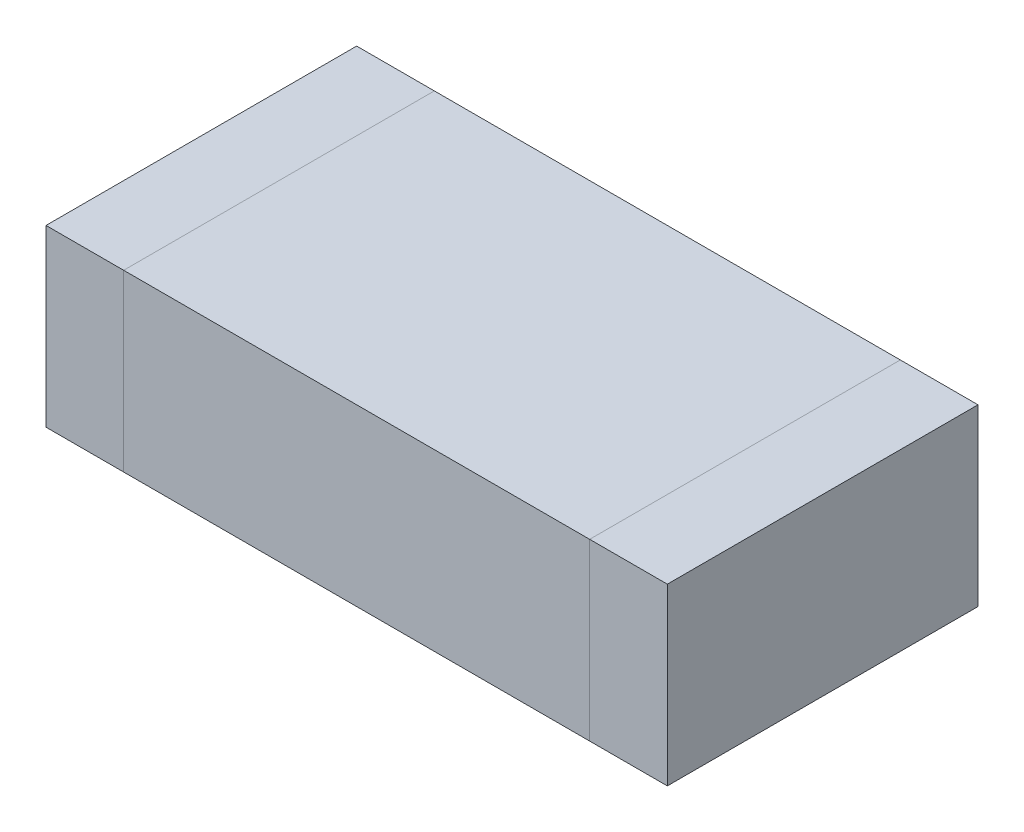
ISO-10303-21;
HEADER;
FILE_DESCRIPTION(('STEP AP214'),'2;1');
FILE_NAME('part.step','',(''),(''),'','','');
FILE_SCHEMA(('AUTOMOTIVE_DESIGN { 1 0 10303 214 1 1 1 1 }'));
ENDSEC;
DATA;
#1=APPLICATION_CONTEXT('core data for automotive mechanical design processes');
#2=APPLICATION_PROTOCOL_DEFINITION('international standard','automotive_design',2000,#1);
#3=PRODUCT_CONTEXT('',#1,'mechanical');
#4=PRODUCT('Part','Part','',(#3));
#5=PRODUCT_RELATED_PRODUCT_CATEGORY('part','',(#4));
#6=PRODUCT_DEFINITION_FORMATION('','',#4);
#7=PRODUCT_DEFINITION_CONTEXT('part definition',#1,'design');
#8=PRODUCT_DEFINITION('design','',#6,#7);
#9=PRODUCT_DEFINITION_SHAPE('','',#8);
#10=(LENGTH_UNIT() NAMED_UNIT(*) SI_UNIT(.MILLI.,.METRE.));
#11=(NAMED_UNIT(*) PLANE_ANGLE_UNIT() SI_UNIT($,.RADIAN.));
#12=(NAMED_UNIT(*) SI_UNIT($,.STERADIAN.) SOLID_ANGLE_UNIT());
#13=UNCERTAINTY_MEASURE_WITH_UNIT(LENGTH_MEASURE(1.E-05),#10,'distance_accuracy_value','');
#14=(GEOMETRIC_REPRESENTATION_CONTEXT(3) GLOBAL_UNCERTAINTY_ASSIGNED_CONTEXT((#13)) GLOBAL_UNIT_ASSIGNED_CONTEXT((#10,
#11,#12)) REPRESENTATION_CONTEXT('',''));
#15=CARTESIAN_POINT('',(0.,0.,0.));
#16=DIRECTION('',(0.,0.,1.));
#17=DIRECTION('',(1.,0.,0.));
#18=AXIS2_PLACEMENT_3D('',#15,#16,#17);
#19=CARTESIAN_POINT('',(-0.6,0.45,0.));
#20=DIRECTION('',(1.,0.,0.));
#21=DIRECTION('',(0.,0.,-1.));
#22=AXIS2_PLACEMENT_3D('',#19,#20,#21);
#23=PLANE('',#22);
#24=DIRECTION('',(0.,0.,1.));
#25=VECTOR('',#24,1.);
#26=CARTESIAN_POINT('',(-0.6,0.45,0.));
#27=LINE('',#26,#25);
#28=CARTESIAN_POINT('',(-0.6,0.45,0.4));
#29=VERTEX_POINT('',#28);
#30=CARTESIAN_POINT('',(-0.6,0.45,-0.4));
#31=VERTEX_POINT('',#30);
#32=EDGE_CURVE('P0_E58',#29,#31,#27,.F.);
#33=ORIENTED_EDGE('',*,*,#32,.F.);
#34=DIRECTION('',(0.,1.,0.));
#35=VECTOR('',#34,1.);
#36=CARTESIAN_POINT('',(-0.6,0.45,0.4));
#37=LINE('',#36,#35);
#38=CARTESIAN_POINT('',(-0.6,0.,0.4));
#39=VERTEX_POINT('',#38);
#40=EDGE_CURVE('P0_E52',#39,#29,#37,.T.);
#41=ORIENTED_EDGE('',*,*,#40,.F.);
#42=DIRECTION('',(0.,0.,1.));
#43=VECTOR('',#42,1.);
#44=CARTESIAN_POINT('',(-0.6,0.,0.));
#45=LINE('',#44,#43);
#46=CARTESIAN_POINT('',(-0.6,0.,-0.4));
#47=VERTEX_POINT('',#46);
#48=EDGE_CURVE('P0_E60',#39,#47,#45,.F.);
#49=ORIENTED_EDGE('',*,*,#48,.T.);
#50=DIRECTION('',(0.,1.,0.));
#51=VECTOR('',#50,1.);
#52=CARTESIAN_POINT('',(-0.6,0.45,-0.4));
#53=LINE('',#52,#51);
#54=EDGE_CURVE('P0_E19',#47,#31,#53,.T.);
#55=ORIENTED_EDGE('',*,*,#54,.T.);
#56=EDGE_LOOP('',(#33,#41,#49,#55));
#57=FACE_BOUND('',#56,.T.);
#58=ADVANCED_FACE('P0_F16',(#57),#23,.T.);
#59=CARTESIAN_POINT('',(0.,0.45,-0.4));
#60=DIRECTION('',(0.,0.,1.));
#61=DIRECTION('',(1.,0.,0.));
#62=AXIS2_PLACEMENT_3D('',#59,#60,#61);
#63=PLANE('',#62);
#64=DIRECTION('',(0.,1.,0.));
#65=VECTOR('',#64,1.);
#66=CARTESIAN_POINT('',(-0.8,0.45,-0.4));
#67=LINE('',#66,#65);
#68=CARTESIAN_POINT('',(-0.8,0.,-0.4));
#69=VERTEX_POINT('',#68);
#70=CARTESIAN_POINT('',(-0.8,0.45,-0.4));
#71=VERTEX_POINT('',#70);
#72=EDGE_CURVE('P0_E74',#69,#71,#67,.T.);
#73=ORIENTED_EDGE('',*,*,#72,.T.);
#74=DIRECTION('',(1.,0.,0.));
#75=VECTOR('',#74,1.);
#76=CARTESIAN_POINT('',(0.,0.45,-0.4));
#77=LINE('',#76,#75);
#78=EDGE_CURVE('P0_E65',#31,#71,#77,.F.);
#79=ORIENTED_EDGE('',*,*,#78,.F.);
#80=ORIENTED_EDGE('',*,*,#54,.F.);
#81=DIRECTION('',(1.,0.,0.));
#82=VECTOR('',#81,1.);
#83=CARTESIAN_POINT('',(0.,0.,-0.4));
#84=LINE('',#83,#82);
#85=EDGE_CURVE('P0_E80',#47,#69,#84,.F.);
#86=ORIENTED_EDGE('',*,*,#85,.T.);
#87=EDGE_LOOP('',(#73,#79,#80,#86));
#88=FACE_BOUND('',#87,.T.);
#89=ADVANCED_FACE('P0_F73',(#88),#63,.F.);
#90=CARTESIAN_POINT('',(0.,0.45,0.));
#91=DIRECTION('',(0.,1.,0.));
#92=DIRECTION('',(0.,0.,1.));
#93=AXIS2_PLACEMENT_3D('',#90,#91,#92);
#94=PLANE('',#93);
#95=DIRECTION('',(1.,0.,0.));
#96=VECTOR('',#95,1.);
#97=CARTESIAN_POINT('',(0.,0.45,0.4));
#98=LINE('',#97,#96);
#99=CARTESIAN_POINT('',(-0.8,0.45,0.4));
#100=VERTEX_POINT('',#99);
#101=EDGE_CURVE('P0_E70',#29,#100,#98,.F.);
#102=ORIENTED_EDGE('',*,*,#101,.F.);
#103=ORIENTED_EDGE('',*,*,#32,.T.);
#104=ORIENTED_EDGE('',*,*,#78,.T.);
#105=DIRECTION('',(0.,0.,-1.));
#106=VECTOR('',#105,1.);
#107=CARTESIAN_POINT('',(-0.8,0.45,0.));
#108=LINE('',#107,#106);
#109=EDGE_CURVE('P0_E83',#71,#100,#108,.F.);
#110=ORIENTED_EDGE('',*,*,#109,.T.);
#111=EDGE_LOOP('',(#102,#103,#104,#110));
#112=FACE_BOUND('',#111,.T.);
#113=ADVANCED_FACE('P0_F67',(#112),#94,.T.);
#114=CARTESIAN_POINT('',(0.,0.45,0.4));
#115=DIRECTION('',(0.,0.,1.));
#116=DIRECTION('',(1.,0.,0.));
#117=AXIS2_PLACEMENT_3D('',#114,#115,#116);
#118=PLANE('',#117);
#119=ORIENTED_EDGE('',*,*,#101,.T.);
#120=DIRECTION('',(0.,1.,0.));
#121=VECTOR('',#120,1.);
#122=CARTESIAN_POINT('',(-0.8,0.45,0.4));
#123=LINE('',#122,#121);
#124=CARTESIAN_POINT('',(-0.8,0.,0.4));
#125=VERTEX_POINT('',#124);
#126=EDGE_CURVE('P0_E25',#100,#125,#123,.F.);
#127=ORIENTED_EDGE('',*,*,#126,.T.);
#128=DIRECTION('',(1.,0.,0.));
#129=VECTOR('',#128,1.);
#130=CARTESIAN_POINT('',(0.,0.,0.4));
#131=LINE('',#130,#129);
#132=EDGE_CURVE('P0_E33',#125,#39,#131,.T.);
#133=ORIENTED_EDGE('',*,*,#132,.T.);
#134=ORIENTED_EDGE('',*,*,#40,.T.);
#135=EDGE_LOOP('',(#119,#127,#133,#134));
#136=FACE_BOUND('',#135,.T.);
#137=ADVANCED_FACE('P0_F87',(#136),#118,.T.);
#138=CARTESIAN_POINT('',(0.,0.,0.));
#139=DIRECTION('',(0.,1.,0.));
#140=DIRECTION('',(0.,0.,1.));
#141=AXIS2_PLACEMENT_3D('',#138,#139,#140);
#142=PLANE('',#141);
#143=ORIENTED_EDGE('',*,*,#48,.F.);
#144=ORIENTED_EDGE('',*,*,#132,.F.);
#145=DIRECTION('',(0.,0.,-1.));
#146=VECTOR('',#145,1.);
#147=CARTESIAN_POINT('',(-0.8,0.,0.));
#148=LINE('',#147,#146);
#149=EDGE_CURVE('P0_E11',#125,#69,#148,.T.);
#150=ORIENTED_EDGE('',*,*,#149,.T.);
#151=ORIENTED_EDGE('',*,*,#85,.F.);
#152=EDGE_LOOP('',(#143,#144,#150,#151));
#153=FACE_BOUND('',#152,.T.);
#154=ADVANCED_FACE('P0_F90',(#153),#142,.F.);
#155=CARTESIAN_POINT('',(-0.8,0.45,0.));
#156=DIRECTION('',(1.,0.,0.));
#157=DIRECTION('',(0.,0.,-1.));
#158=AXIS2_PLACEMENT_3D('',#155,#156,#157);
#159=PLANE('',#158);
#160=ORIENTED_EDGE('',*,*,#126,.F.);
#161=ORIENTED_EDGE('',*,*,#109,.F.);
#162=ORIENTED_EDGE('',*,*,#72,.F.);
#163=ORIENTED_EDGE('',*,*,#149,.F.);
#164=EDGE_LOOP('',(#160,#161,#162,#163));
#165=FACE_BOUND('',#164,.T.);
#166=ADVANCED_FACE('P0_F89',(#165),#159,.F.);
#167=CLOSED_SHELL('',(#58,#89,#113,#137,#154,#166));
#168=MANIFOLD_SOLID_BREP('P0_B1',#167);
#169=CARTESIAN_POINT('',(0.,0.,0.));
#170=DIRECTION('',(0.,1.,0.));
#171=DIRECTION('',(0.,0.,1.));
#172=AXIS2_PLACEMENT_3D('',#169,#170,#171);
#173=PLANE('',#172);
#174=DIRECTION('',(0.,0.,-1.));
#175=VECTOR('',#174,1.);
#176=CARTESIAN_POINT('',(-0.6,0.,0.));
#177=LINE('',#176,#175);
#178=CARTESIAN_POINT('',(-0.6,0.,0.4));
#179=VERTEX_POINT('',#178);
#180=CARTESIAN_POINT('',(-0.6,0.,-0.4));
#181=VERTEX_POINT('',#180);
#182=EDGE_CURVE('P1_E80',#179,#181,#177,.T.);
#183=ORIENTED_EDGE('',*,*,#182,.T.);
#184=DIRECTION('',(-1.,0.,0.));
#185=VECTOR('',#184,1.);
#186=CARTESIAN_POINT('',(0.,0.,-0.4));
#187=LINE('',#186,#185);
#188=CARTESIAN_POINT('',(0.6,0.,-0.4));
#189=VERTEX_POINT('',#188);
#190=EDGE_CURVE('P1_E54',#189,#181,#187,.T.);
#191=ORIENTED_EDGE('',*,*,#190,.F.);
#192=DIRECTION('',(0.,0.,-1.));
#193=VECTOR('',#192,1.);
#194=CARTESIAN_POINT('',(0.6,0.,0.));
#195=LINE('',#194,#193);
#196=CARTESIAN_POINT('',(0.6,0.,0.4));
#197=VERTEX_POINT('',#196);
#198=EDGE_CURVE('P1_E56',#197,#189,#195,.T.);
#199=ORIENTED_EDGE('',*,*,#198,.F.);
#200=DIRECTION('',(-1.,0.,0.));
#201=VECTOR('',#200,1.);
#202=CARTESIAN_POINT('',(0.,0.,0.4));
#203=LINE('',#202,#201);
#204=EDGE_CURVE('P1_E19',#197,#179,#203,.T.);
#205=ORIENTED_EDGE('',*,*,#204,.T.);
#206=EDGE_LOOP('',(#183,#191,#199,#205));
#207=FACE_BOUND('',#206,.T.);
#208=ADVANCED_FACE('P1_F16',(#207),#173,.F.);
#209=CARTESIAN_POINT('',(0.,0.45,0.4));
#210=DIRECTION('',(0.,0.,-1.));
#211=DIRECTION('',(-1.,0.,0.));
#212=AXIS2_PLACEMENT_3D('',#209,#210,#211);
#213=PLANE('',#212);
#214=DIRECTION('',(0.,1.,0.));
#215=VECTOR('',#214,1.);
#216=CARTESIAN_POINT('',(0.6,0.45,0.4));
#217=LINE('',#216,#215);
#218=CARTESIAN_POINT('',(0.6,0.45,0.4));
#219=VERTEX_POINT('',#218);
#220=EDGE_CURVE('P1_E62',#219,#197,#217,.F.);
#221=ORIENTED_EDGE('',*,*,#220,.F.);
#222=DIRECTION('',(1.,0.,0.));
#223=VECTOR('',#222,1.);
#224=CARTESIAN_POINT('',(0.,0.45,0.4));
#225=LINE('',#224,#223);
#226=CARTESIAN_POINT('',(-0.6,0.45,0.4));
#227=VERTEX_POINT('',#226);
#228=EDGE_CURVE('P1_E82',#227,#219,#225,.T.);
#229=ORIENTED_EDGE('',*,*,#228,.F.);
#230=DIRECTION('',(0.,1.,0.));
#231=VECTOR('',#230,1.);
#232=CARTESIAN_POINT('',(-0.6,0.45,0.4));
#233=LINE('',#232,#231);
#234=EDGE_CURVE('P1_E67',#227,#179,#233,.F.);
#235=ORIENTED_EDGE('',*,*,#234,.T.);
#236=ORIENTED_EDGE('',*,*,#204,.F.);
#237=EDGE_LOOP('',(#221,#229,#235,#236));
#238=FACE_BOUND('',#237,.T.);
#239=ADVANCED_FACE('P1_F64',(#238),#213,.F.);
#240=CARTESIAN_POINT('',(0.6,0.45,0.));
#241=DIRECTION('',(1.,0.,0.));
#242=DIRECTION('',(0.,0.,-1.));
#243=AXIS2_PLACEMENT_3D('',#240,#241,#242);
#244=PLANE('',#243);
#245=DIRECTION('',(0.,0.,1.));
#246=VECTOR('',#245,1.);
#247=CARTESIAN_POINT('',(0.6,0.45,0.));
#248=LINE('',#247,#246);
#249=CARTESIAN_POINT('',(0.6,0.45,-0.4));
#250=VERTEX_POINT('',#249);
#251=EDGE_CURVE('P1_E71',#219,#250,#248,.F.);
#252=ORIENTED_EDGE('',*,*,#251,.F.);
#253=ORIENTED_EDGE('',*,*,#220,.T.);
#254=ORIENTED_EDGE('',*,*,#198,.T.);
#255=DIRECTION('',(0.,1.,0.));
#256=VECTOR('',#255,1.);
#257=CARTESIAN_POINT('',(0.6,0.45,-0.4));
#258=LINE('',#257,#256);
#259=EDGE_CURVE('P1_E74',#250,#189,#258,.F.);
#260=ORIENTED_EDGE('',*,*,#259,.F.);
#261=EDGE_LOOP('',(#252,#253,#254,#260));
#262=FACE_BOUND('',#261,.T.);
#263=ADVANCED_FACE('P1_F69',(#262),#244,.T.);
#264=CARTESIAN_POINT('',(0.,0.45,-0.4));
#265=DIRECTION('',(0.,0.,-1.));
#266=DIRECTION('',(-1.,0.,0.));
#267=AXIS2_PLACEMENT_3D('',#264,#265,#266);
#268=PLANE('',#267);
#269=DIRECTION('',(1.,0.,0.));
#270=VECTOR('',#269,1.);
#271=CARTESIAN_POINT('',(0.,0.45,-0.4));
#272=LINE('',#271,#270);
#273=CARTESIAN_POINT('',(-0.6,0.45,-0.4));
#274=VERTEX_POINT('',#273);
#275=EDGE_CURVE('P1_E25',#250,#274,#272,.F.);
#276=ORIENTED_EDGE('',*,*,#275,.F.);
#277=ORIENTED_EDGE('',*,*,#259,.T.);
#278=ORIENTED_EDGE('',*,*,#190,.T.);
#279=DIRECTION('',(0.,1.,0.));
#280=VECTOR('',#279,1.);
#281=CARTESIAN_POINT('',(-0.6,0.45,-0.4));
#282=LINE('',#281,#280);
#283=EDGE_CURVE('P1_E34',#181,#274,#282,.T.);
#284=ORIENTED_EDGE('',*,*,#283,.T.);
#285=EDGE_LOOP('',(#276,#277,#278,#284));
#286=FACE_BOUND('',#285,.T.);
#287=ADVANCED_FACE('P1_F88',(#286),#268,.T.);
#288=CARTESIAN_POINT('',(-0.6,0.45,0.));
#289=DIRECTION('',(1.,0.,0.));
#290=DIRECTION('',(0.,0.,-1.));
#291=AXIS2_PLACEMENT_3D('',#288,#289,#290);
#292=PLANE('',#291);
#293=ORIENTED_EDGE('',*,*,#234,.F.);
#294=DIRECTION('',(0.,0.,1.));
#295=VECTOR('',#294,1.);
#296=CARTESIAN_POINT('',(-0.6,0.45,0.));
#297=LINE('',#296,#295);
#298=EDGE_CURVE('P1_E11',#274,#227,#297,.T.);
#299=ORIENTED_EDGE('',*,*,#298,.F.);
#300=ORIENTED_EDGE('',*,*,#283,.F.);
#301=ORIENTED_EDGE('',*,*,#182,.F.);
#302=EDGE_LOOP('',(#293,#299,#300,#301));
#303=FACE_BOUND('',#302,.T.);
#304=ADVANCED_FACE('P1_F90',(#303),#292,.F.);
#305=CARTESIAN_POINT('',(0.,0.45,0.));
#306=DIRECTION('',(0.,1.,0.));
#307=DIRECTION('',(0.,0.,1.));
#308=AXIS2_PLACEMENT_3D('',#305,#306,#307);
#309=PLANE('',#308);
#310=ORIENTED_EDGE('',*,*,#275,.T.);
#311=ORIENTED_EDGE('',*,*,#298,.T.);
#312=ORIENTED_EDGE('',*,*,#228,.T.);
#313=ORIENTED_EDGE('',*,*,#251,.T.);
#314=EDGE_LOOP('',(#310,#311,#312,#313));
#315=FACE_BOUND('',#314,.T.);
#316=ADVANCED_FACE('P1_F87',(#315),#309,.T.);
#317=CLOSED_SHELL('',(#208,#239,#263,#287,#304,#316));
#318=MANIFOLD_SOLID_BREP('P1_B1',#317);
#319=CARTESIAN_POINT('',(0.6,0.45,0.));
#320=DIRECTION('',(1.,0.,0.));
#321=DIRECTION('',(0.,0.,-1.));
#322=AXIS2_PLACEMENT_3D('',#319,#320,#321);
#323=PLANE('',#322);
#324=DIRECTION('',(0.,1.,0.));
#325=VECTOR('',#324,1.);
#326=CARTESIAN_POINT('',(0.6,0.45,0.4));
#327=LINE('',#326,#325);
#328=CARTESIAN_POINT('',(0.6,0.,0.4));
#329=VERTEX_POINT('',#328);
#330=CARTESIAN_POINT('',(0.6,0.45,0.4));
#331=VERTEX_POINT('',#330);
#332=EDGE_CURVE('P2_E78',#329,#331,#327,.T.);
#333=ORIENTED_EDGE('',*,*,#332,.T.);
#334=DIRECTION('',(0.,0.,1.));
#335=VECTOR('',#334,1.);
#336=CARTESIAN_POINT('',(0.6,0.45,0.));
#337=LINE('',#336,#335);
#338=CARTESIAN_POINT('',(0.6,0.45,-0.4));
#339=VERTEX_POINT('',#338);
#340=EDGE_CURVE('P2_E67',#339,#331,#337,.T.);
#341=ORIENTED_EDGE('',*,*,#340,.F.);
#342=DIRECTION('',(0.,1.,0.));
#343=VECTOR('',#342,1.);
#344=CARTESIAN_POINT('',(0.6,0.45,-0.4));
#345=LINE('',#344,#343);
#346=CARTESIAN_POINT('',(0.6,0.,-0.4));
#347=VERTEX_POINT('',#346);
#348=EDGE_CURVE('P2_E55',#347,#339,#345,.T.);
#349=ORIENTED_EDGE('',*,*,#348,.F.);
#350=DIRECTION('',(0.,0.,1.));
#351=VECTOR('',#350,1.);
#352=CARTESIAN_POINT('',(0.6,0.,0.));
#353=LINE('',#352,#351);
#354=EDGE_CURVE('P2_E19',#347,#329,#353,.T.);
#355=ORIENTED_EDGE('',*,*,#354,.T.);
#356=EDGE_LOOP('',(#333,#341,#349,#355));
#357=FACE_BOUND('',#356,.T.);
#358=ADVANCED_FACE('P2_F16',(#357),#323,.F.);
#359=CARTESIAN_POINT('',(0.,0.,0.));
#360=DIRECTION('',(0.,1.,0.));
#361=DIRECTION('',(0.,0.,1.));
#362=AXIS2_PLACEMENT_3D('',#359,#360,#361);
#363=PLANE('',#362);
#364=DIRECTION('',(-1.,0.,0.));
#365=VECTOR('',#364,1.);
#366=CARTESIAN_POINT('',(0.,0.,0.4));
#367=LINE('',#366,#365);
#368=CARTESIAN_POINT('',(0.8,0.,0.4));
#369=VERTEX_POINT('',#368);
#370=EDGE_CURVE('P2_E64',#369,#329,#367,.T.);
#371=ORIENTED_EDGE('',*,*,#370,.T.);
#372=ORIENTED_EDGE('',*,*,#354,.F.);
#373=DIRECTION('',(-1.,0.,0.));
#374=VECTOR('',#373,1.);
#375=CARTESIAN_POINT('',(0.,0.,-0.4));
#376=LINE('',#375,#374);
#377=CARTESIAN_POINT('',(0.8,0.,-0.4));
#378=VERTEX_POINT('',#377);
#379=EDGE_CURVE('P2_E61',#378,#347,#376,.T.);
#380=ORIENTED_EDGE('',*,*,#379,.F.);
#381=DIRECTION('',(0.,0.,-1.));
#382=VECTOR('',#381,1.);
#383=CARTESIAN_POINT('',(0.8,0.,0.));
#384=LINE('',#383,#382);
#385=EDGE_CURVE('P2_E82',#369,#378,#384,.T.);
#386=ORIENTED_EDGE('',*,*,#385,.F.);
#387=EDGE_LOOP('',(#371,#372,#380,#386));
#388=FACE_BOUND('',#387,.T.);
#389=ADVANCED_FACE('P2_F60',(#388),#363,.F.);
#390=CARTESIAN_POINT('',(0.,0.45,-0.4));
#391=DIRECTION('',(0.,0.,-1.));
#392=DIRECTION('',(-1.,0.,0.));
#393=AXIS2_PLACEMENT_3D('',#390,#391,#392);
#394=PLANE('',#393);
#395=DIRECTION('',(1.,0.,0.));
#396=VECTOR('',#395,1.);
#397=CARTESIAN_POINT('',(0.,0.45,-0.4));
#398=LINE('',#397,#396);
#399=CARTESIAN_POINT('',(0.8,0.45,-0.4));
#400=VERTEX_POINT('',#399);
#401=EDGE_CURVE('P2_E69',#400,#339,#398,.F.);
#402=ORIENTED_EDGE('',*,*,#401,.F.);
#403=DIRECTION('',(0.,1.,0.));
#404=VECTOR('',#403,1.);
#405=CARTESIAN_POINT('',(0.8,0.45,-0.4));
#406=LINE('',#405,#404);
#407=EDGE_CURVE('P2_E73',#378,#400,#406,.T.);
#408=ORIENTED_EDGE('',*,*,#407,.F.);
#409=ORIENTED_EDGE('',*,*,#379,.T.);
#410=ORIENTED_EDGE('',*,*,#348,.T.);
#411=EDGE_LOOP('',(#402,#408,#409,#410));
#412=FACE_BOUND('',#411,.T.);
#413=ADVANCED_FACE('P2_F71',(#412),#394,.T.);
#414=CARTESIAN_POINT('',(0.,0.45,0.));
#415=DIRECTION('',(0.,1.,0.));
#416=DIRECTION('',(0.,0.,1.));
#417=AXIS2_PLACEMENT_3D('',#414,#415,#416);
#418=PLANE('',#417);
#419=ORIENTED_EDGE('',*,*,#340,.T.);
#420=DIRECTION('',(-1.,0.,0.));
#421=VECTOR('',#420,1.);
#422=CARTESIAN_POINT('',(0.,0.45,0.4));
#423=LINE('',#422,#421);
#424=CARTESIAN_POINT('',(0.8,0.45,0.4));
#425=VERTEX_POINT('',#424);
#426=EDGE_CURVE('P2_E34',#331,#425,#423,.F.);
#427=ORIENTED_EDGE('',*,*,#426,.T.);
#428=DIRECTION('',(0.,0.,-1.));
#429=VECTOR('',#428,1.);
#430=CARTESIAN_POINT('',(0.8,0.45,0.));
#431=LINE('',#430,#429);
#432=EDGE_CURVE('P2_E25',#400,#425,#431,.F.);
#433=ORIENTED_EDGE('',*,*,#432,.F.);
#434=ORIENTED_EDGE('',*,*,#401,.T.);
#435=EDGE_LOOP('',(#419,#427,#433,#434));
#436=FACE_BOUND('',#435,.T.);
#437=ADVANCED_FACE('P2_F88',(#436),#418,.T.);
#438=CARTESIAN_POINT('',(0.,0.45,0.4));
#439=DIRECTION('',(0.,0.,-1.));
#440=DIRECTION('',(-1.,0.,0.));
#441=AXIS2_PLACEMENT_3D('',#438,#439,#440);
#442=PLANE('',#441);
#443=DIRECTION('',(0.,1.,0.));
#444=VECTOR('',#443,1.);
#445=CARTESIAN_POINT('',(0.8,0.45,0.4));
#446=LINE('',#445,#444);
#447=EDGE_CURVE('P2_E11',#425,#369,#446,.F.);
#448=ORIENTED_EDGE('',*,*,#447,.F.);
#449=ORIENTED_EDGE('',*,*,#426,.F.);
#450=ORIENTED_EDGE('',*,*,#332,.F.);
#451=ORIENTED_EDGE('',*,*,#370,.F.);
#452=EDGE_LOOP('',(#448,#449,#450,#451));
#453=FACE_BOUND('',#452,.T.);
#454=ADVANCED_FACE('P2_F90',(#453),#442,.F.);
#455=CARTESIAN_POINT('',(0.8,0.45,0.));
#456=DIRECTION('',(1.,0.,0.));
#457=DIRECTION('',(0.,0.,-1.));
#458=AXIS2_PLACEMENT_3D('',#455,#456,#457);
#459=PLANE('',#458);
#460=ORIENTED_EDGE('',*,*,#432,.T.);
#461=ORIENTED_EDGE('',*,*,#447,.T.);
#462=ORIENTED_EDGE('',*,*,#385,.T.);
#463=ORIENTED_EDGE('',*,*,#407,.T.);
#464=EDGE_LOOP('',(#460,#461,#462,#463));
#465=FACE_BOUND('',#464,.T.);
#466=ADVANCED_FACE('P2_F87',(#465),#459,.T.);
#467=CLOSED_SHELL('',(#358,#389,#413,#437,#454,#466));
#468=MANIFOLD_SOLID_BREP('P2_B1',#467);
#469=ADVANCED_BREP_SHAPE_REPRESENTATION('',(#18,#168,#318,#468),#14);
#470=SHAPE_DEFINITION_REPRESENTATION(#9,#469);
ENDSEC;
END-ISO-10303-21;
